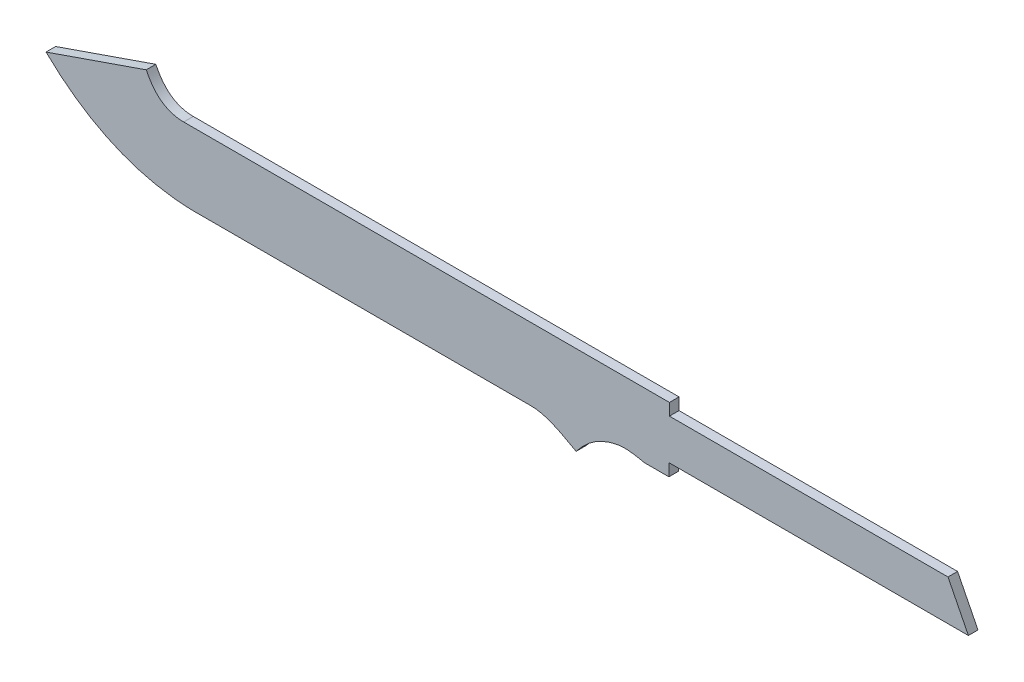
ISO-10303-21;
HEADER;
FILE_DESCRIPTION(('STEP AP214'),'2;1');
FILE_NAME('part.step','',(''),(''),'','','');
FILE_SCHEMA(('AUTOMOTIVE_DESIGN { 1 0 10303 214 1 1 1 1 }'));
ENDSEC;
DATA;
#1=APPLICATION_CONTEXT('core data for automotive mechanical design processes');
#2=APPLICATION_PROTOCOL_DEFINITION('international standard','automotive_design',2000,#1);
#3=PRODUCT_CONTEXT('',#1,'mechanical');
#4=PRODUCT('Part','Part','',(#3));
#5=PRODUCT_RELATED_PRODUCT_CATEGORY('part','',(#4));
#6=PRODUCT_DEFINITION_FORMATION('','',#4);
#7=PRODUCT_DEFINITION_CONTEXT('part definition',#1,'design');
#8=PRODUCT_DEFINITION('design','',#6,#7);
#9=PRODUCT_DEFINITION_SHAPE('','',#8);
#10=(LENGTH_UNIT() NAMED_UNIT(*) SI_UNIT(.MILLI.,.METRE.));
#11=(NAMED_UNIT(*) PLANE_ANGLE_UNIT() SI_UNIT($,.RADIAN.));
#12=(NAMED_UNIT(*) SI_UNIT($,.STERADIAN.) SOLID_ANGLE_UNIT());
#13=UNCERTAINTY_MEASURE_WITH_UNIT(LENGTH_MEASURE(1.E-05),#10,'distance_accuracy_value','');
#14=(GEOMETRIC_REPRESENTATION_CONTEXT(3) GLOBAL_UNCERTAINTY_ASSIGNED_CONTEXT((#13)) GLOBAL_UNIT_ASSIGNED_CONTEXT((#10,
#11,#12)) REPRESENTATION_CONTEXT('',''));
#15=CARTESIAN_POINT('',(0.,0.,0.));
#16=DIRECTION('',(0.,0.,1.));
#17=DIRECTION('',(1.,0.,0.));
#18=AXIS2_PLACEMENT_3D('',#15,#16,#17);
#19=CARTESIAN_POINT('',(831.647452370836,366.448530177289,3.5));
#20=DIRECTION('',(-0.893086000947505,-0.449885979901123,0.));
#21=DIRECTION('',(0.449885979901123,-0.893086000947505,0.));
#22=AXIS2_PLACEMENT_3D('',#19,#20,#21);
#23=PLANE('',#22);
#24=DIRECTION('',(-0.449885979901123,0.893086000947505,0.));
#25=VECTOR('',#24,1.);
#26=CARTESIAN_POINT('',(831.647452370836,366.448530177289,-3.5));
#27=LINE('',#26,#25);
#28=CARTESIAN_POINT('',(846.526721269649,336.911119918841,-3.5));
#29=VERTEX_POINT('',#28);
#30=CARTESIAN_POINT('',(831.647452370836,366.448530177289,-3.5));
#31=VERTEX_POINT('',#30);
#32=EDGE_CURVE('E167',#29,#31,#27,.T.);
#33=ORIENTED_EDGE('',*,*,#32,.T.);
#34=DIRECTION('',(0.,0.,-1.));
#35=VECTOR('',#34,1.);
#36=CARTESIAN_POINT('',(831.647452370836,366.448530177289,3.5));
#37=LINE('',#36,#35);
#38=CARTESIAN_POINT('',(831.647452370836,366.448530177289,3.5));
#39=VERTEX_POINT('',#38);
#40=EDGE_CURVE('E11',#39,#31,#37,.T.);
#41=ORIENTED_EDGE('',*,*,#40,.F.);
#42=DIRECTION('',(-0.449885979901123,0.893086000947505,0.));
#43=VECTOR('',#42,1.);
#44=CARTESIAN_POINT('',(831.647452370836,366.448530177289,3.5));
#45=LINE('',#44,#43);
#46=CARTESIAN_POINT('',(846.526721269649,336.911119918841,3.5));
#47=VERTEX_POINT('',#46);
#48=EDGE_CURVE('E218',#47,#39,#45,.T.);
#49=ORIENTED_EDGE('',*,*,#48,.F.);
#50=DIRECTION('',(0.,0.,-1.));
#51=VECTOR('',#50,1.);
#52=CARTESIAN_POINT('',(846.526721269649,336.911119918841,3.5));
#53=LINE('',#52,#51);
#54=EDGE_CURVE('E163',#47,#29,#53,.T.);
#55=ORIENTED_EDGE('',*,*,#54,.T.);
#56=EDGE_LOOP('',(#33,#41,#49,#55));
#57=FACE_BOUND('',#56,.T.);
#58=ADVANCED_FACE('F35',(#57),#23,.F.);
#59=CARTESIAN_POINT('',(831.647452370836,366.448530177289,3.5));
#60=DIRECTION('',(0.,-1.,0.));
#61=DIRECTION('',(0.,0.,-1.));
#62=AXIS2_PLACEMENT_3D('',#59,#60,#61);
#63=PLANE('',#62);
#64=DIRECTION('',(-1.,0.,0.));
#65=VECTOR('',#64,1.);
#66=CARTESIAN_POINT('',(831.647452370836,366.448530177289,-3.5));
#67=LINE('',#66,#65);
#68=CARTESIAN_POINT('',(628.572821228741,366.448530177289,-3.5));
#69=VERTEX_POINT('',#68);
#70=EDGE_CURVE('E170',#31,#69,#67,.T.);
#71=ORIENTED_EDGE('',*,*,#70,.T.);
#72=DIRECTION('',(0.,0.,-1.));
#73=VECTOR('',#72,1.);
#74=CARTESIAN_POINT('',(628.572821228741,366.448530177289,3.5));
#75=LINE('',#74,#73);
#76=CARTESIAN_POINT('',(628.572821228741,366.448530177289,3.5));
#77=VERTEX_POINT('',#76);
#78=EDGE_CURVE('E43',#77,#69,#75,.T.);
#79=ORIENTED_EDGE('',*,*,#78,.F.);
#80=DIRECTION('',(-1.,0.,0.));
#81=VECTOR('',#80,1.);
#82=CARTESIAN_POINT('',(831.647452370836,366.448530177289,3.5));
#83=LINE('',#82,#81);
#84=EDGE_CURVE('E112',#39,#77,#83,.T.);
#85=ORIENTED_EDGE('',*,*,#84,.F.);
#86=ORIENTED_EDGE('',*,*,#40,.T.);
#87=EDGE_LOOP('',(#71,#79,#85,#86));
#88=FACE_BOUND('',#87,.T.);
#89=ADVANCED_FACE('F291',(#88),#63,.F.);
#90=CARTESIAN_POINT('',(628.572821228741,366.448530177289,3.5));
#91=DIRECTION('',(-1.,0.,0.));
#92=DIRECTION('',(0.,0.,1.));
#93=AXIS2_PLACEMENT_3D('',#90,#91,#92);
#94=PLANE('',#93);
#95=DIRECTION('',(0.,1.,0.));
#96=VECTOR('',#95,1.);
#97=CARTESIAN_POINT('',(628.572821228741,366.448530177289,-3.5));
#98=LINE('',#97,#96);
#99=CARTESIAN_POINT('',(628.572821228741,375.10698999372,-3.5));
#100=VERTEX_POINT('',#99);
#101=EDGE_CURVE('E172',#69,#100,#98,.T.);
#102=ORIENTED_EDGE('',*,*,#101,.T.);
#103=DIRECTION('',(0.,0.,-1.));
#104=VECTOR('',#103,1.);
#105=CARTESIAN_POINT('',(628.572821228741,375.10698999372,3.5));
#106=LINE('',#105,#104);
#107=CARTESIAN_POINT('',(628.572821228741,375.10698999372,3.5));
#108=VERTEX_POINT('',#107);
#109=EDGE_CURVE('E243',#108,#100,#106,.T.);
#110=ORIENTED_EDGE('',*,*,#109,.F.);
#111=DIRECTION('',(0.,1.,0.));
#112=VECTOR('',#111,1.);
#113=CARTESIAN_POINT('',(628.572821228741,366.448530177289,3.5));
#114=LINE('',#113,#112);
#115=EDGE_CURVE('E251',#77,#108,#114,.T.);
#116=ORIENTED_EDGE('',*,*,#115,.F.);
#117=ORIENTED_EDGE('',*,*,#78,.T.);
#118=EDGE_LOOP('',(#102,#110,#116,#117));
#119=FACE_BOUND('',#118,.T.);
#120=ADVANCED_FACE('F249',(#119),#94,.F.);
#121=CARTESIAN_POINT('',(628.572821228741,375.10698999372,3.5));
#122=DIRECTION('',(0.,-1.,0.));
#123=DIRECTION('',(0.,0.,-1.));
#124=AXIS2_PLACEMENT_3D('',#121,#122,#123);
#125=PLANE('',#124);
#126=DIRECTION('',(-1.,0.,0.));
#127=VECTOR('',#126,1.);
#128=CARTESIAN_POINT('',(628.572821228741,375.10698999372,-3.5));
#129=LINE('',#128,#127);
#130=CARTESIAN_POINT('',(274.428895498994,375.10698999372,-3.5));
#131=VERTEX_POINT('',#130);
#132=EDGE_CURVE('E174',#100,#131,#129,.T.);
#133=ORIENTED_EDGE('',*,*,#132,.T.);
#134=DIRECTION('',(0.,0.,-1.));
#135=VECTOR('',#134,1.);
#136=CARTESIAN_POINT('',(274.428895498994,375.10698999372,3.5));
#137=LINE('',#136,#135);
#138=CARTESIAN_POINT('',(274.428895498994,375.10698999372,3.5));
#139=VERTEX_POINT('',#138);
#140=EDGE_CURVE('E240',#139,#131,#137,.T.);
#141=ORIENTED_EDGE('',*,*,#140,.F.);
#142=DIRECTION('',(-1.,0.,0.));
#143=VECTOR('',#142,1.);
#144=CARTESIAN_POINT('',(628.572821228741,375.10698999372,3.5));
#145=LINE('',#144,#143);
#146=EDGE_CURVE('E269',#108,#139,#145,.T.);
#147=ORIENTED_EDGE('',*,*,#146,.F.);
#148=ORIENTED_EDGE('',*,*,#109,.T.);
#149=EDGE_LOOP('',(#133,#141,#147,#148));
#150=FACE_BOUND('',#149,.T.);
#151=ADVANCED_FACE('F260',(#150),#125,.F.);
#152=CARTESIAN_POINT('',(274.428895498994,375.10698999372,3.5));
#153=CARTESIAN_POINT('',(256.358547923985,375.10698999372,3.5));
#154=CARTESIAN_POINT('',(247.122592496758,394.38356937402,3.5));
#155=B_SPLINE_CURVE_WITH_KNOTS('',2,(#152,#153,#154),.UNSPECIFIED.,.F.,.F.,(3,3),(0.,1.),.UNSPECIFIED.);
#156=DIRECTION('',(0.,0.,-1.));
#157=VECTOR('',#156,1.);
#158=SURFACE_OF_LINEAR_EXTRUSION('',#155,#157);
#159=CARTESIAN_POINT('',(274.428895498994,375.10698999372,-3.5));
#160=CARTESIAN_POINT('',(256.358547923985,375.10698999372,-3.5));
#161=CARTESIAN_POINT('',(247.122592496758,394.38356937402,-3.5));
#162=B_SPLINE_CURVE_WITH_KNOTS('',2,(#159,#160,#161),.UNSPECIFIED.,.F.,.F.,(3,3),(0.,1.),.UNSPECIFIED.);
#163=CARTESIAN_POINT('',(247.122592496758,394.38356937402,-3.5));
#164=VERTEX_POINT('',#163);
#165=EDGE_CURVE('E176',#131,#164,#162,.T.);
#166=ORIENTED_EDGE('',*,*,#165,.T.);
#167=DIRECTION('',(0.,0.,-1.));
#168=VECTOR('',#167,1.);
#169=CARTESIAN_POINT('',(247.122592496758,394.38356937402,3.5));
#170=LINE('',#169,#168);
#171=CARTESIAN_POINT('',(247.122592496758,394.38356937402,3.5));
#172=VERTEX_POINT('',#171);
#173=EDGE_CURVE('E237',#172,#164,#170,.T.);
#174=ORIENTED_EDGE('',*,*,#173,.F.);
#175=EDGE_CURVE('E266',#139,#172,#155,.T.);
#176=ORIENTED_EDGE('',*,*,#175,.F.);
#177=ORIENTED_EDGE('',*,*,#140,.T.);
#178=EDGE_LOOP('',(#166,#174,#176,#177));
#179=FACE_BOUND('',#178,.T.);
#180=ADVANCED_FACE('F264',(#179),#158,.F.);
#181=CARTESIAN_POINT('',(247.122592496758,394.38356937402,3.5));
#182=DIRECTION('',(0.327110563883166,-0.944986073440258,0.));
#183=DIRECTION('',(0.944986073440258,0.327110563883166,0.));
#184=AXIS2_PLACEMENT_3D('',#181,#182,#183);
#185=PLANE('',#184);
#186=DIRECTION('',(-0.944986073440258,-0.327110563883166,0.));
#187=VECTOR('',#186,1.);
#188=CARTESIAN_POINT('',(247.122592496758,394.38356937402,-3.5));
#189=LINE('',#188,#187);
#190=CARTESIAN_POINT('',(174.038075637833,369.085082769007,-3.5));
#191=VERTEX_POINT('',#190);
#192=EDGE_CURVE('E180',#164,#191,#189,.T.);
#193=ORIENTED_EDGE('',*,*,#192,.T.);
#194=DIRECTION('',(0.,0.,-1.));
#195=VECTOR('',#194,1.);
#196=CARTESIAN_POINT('',(174.038075637833,369.085082769007,3.5));
#197=LINE('',#196,#195);
#198=CARTESIAN_POINT('',(174.038075637833,369.085082769007,3.5));
#199=VERTEX_POINT('',#198);
#200=EDGE_CURVE('E234',#199,#191,#197,.T.);
#201=ORIENTED_EDGE('',*,*,#200,.F.);
#202=DIRECTION('',(-0.944986073440258,-0.327110563883166,0.));
#203=VECTOR('',#202,1.);
#204=CARTESIAN_POINT('',(247.122592496758,394.38356937402,3.5));
#205=LINE('',#204,#203);
#206=EDGE_CURVE('E268',#172,#199,#205,.T.);
#207=ORIENTED_EDGE('',*,*,#206,.F.);
#208=ORIENTED_EDGE('',*,*,#173,.T.);
#209=EDGE_LOOP('',(#193,#201,#207,#208));
#210=FACE_BOUND('',#209,.T.);
#211=ADVANCED_FACE('F286',(#210),#185,.F.);
#212=CARTESIAN_POINT('',(174.038075637833,369.085082769007,3.5));
#213=CARTESIAN_POINT('',(207.417770849194,336.709288165507,3.5));
#214=CARTESIAN_POINT('',(244.126187853179,323.555937747538,3.5));
#215=CARTESIAN_POINT('',(280.251563050941,322.503742353429,3.5));
#216=B_SPLINE_CURVE_WITH_KNOTS('',3,(#212,#213,#214,#215),.UNSPECIFIED.,.F.,.F.,(4,4),(0.,1.),.UNSPECIFIED.);
#217=DIRECTION('',(0.,0.,-1.));
#218=VECTOR('',#217,1.);
#219=SURFACE_OF_LINEAR_EXTRUSION('',#216,#218);
#220=CARTESIAN_POINT('',(174.038075637833,369.085082769007,-3.5));
#221=CARTESIAN_POINT('',(207.417770849194,336.709288165507,-3.5));
#222=CARTESIAN_POINT('',(244.126187853179,323.555937747538,-3.5));
#223=CARTESIAN_POINT('',(280.251563050941,322.503742353429,-3.5));
#224=B_SPLINE_CURVE_WITH_KNOTS('',3,(#220,#221,#222,#223),.UNSPECIFIED.,.F.,.F.,(4,4),(0.,1.),.UNSPECIFIED.);
#225=CARTESIAN_POINT('',(280.251563050941,322.503742353429,-3.5));
#226=VERTEX_POINT('',#225);
#227=EDGE_CURVE('E185',#191,#226,#224,.T.);
#228=ORIENTED_EDGE('',*,*,#227,.T.);
#229=DIRECTION('',(0.,0.,-1.));
#230=VECTOR('',#229,1.);
#231=CARTESIAN_POINT('',(280.251563050941,322.503742353429,3.5));
#232=LINE('',#231,#230);
#233=CARTESIAN_POINT('',(280.251563050941,322.503742353429,3.5));
#234=VERTEX_POINT('',#233);
#235=EDGE_CURVE('E231',#234,#226,#232,.T.);
#236=ORIENTED_EDGE('',*,*,#235,.F.);
#237=EDGE_CURVE('E271',#199,#234,#216,.T.);
#238=ORIENTED_EDGE('',*,*,#237,.F.);
#239=ORIENTED_EDGE('',*,*,#200,.T.);
#240=EDGE_LOOP('',(#228,#236,#238,#239));
#241=FACE_BOUND('',#240,.T.);
#242=ADVANCED_FACE('F324',(#241),#219,.F.);
#243=CARTESIAN_POINT('',(280.251563050941,322.503742353429,3.5));
#244=DIRECTION('',(0.,1.,0.));
#245=DIRECTION('',(0.,0.,1.));
#246=AXIS2_PLACEMENT_3D('',#243,#244,#245);
#247=PLANE('',#246);
#248=DIRECTION('',(1.,0.,0.));
#249=VECTOR('',#248,1.);
#250=CARTESIAN_POINT('',(280.251563050941,322.503742353429,-3.5));
#251=LINE('',#250,#249);
#252=CARTESIAN_POINT('',(527.843524378367,322.503742353429,-3.5));
#253=VERTEX_POINT('',#252);
#254=EDGE_CURVE('E189',#226,#253,#251,.T.);
#255=ORIENTED_EDGE('',*,*,#254,.T.);
#256=DIRECTION('',(0.,0.,-1.));
#257=VECTOR('',#256,1.);
#258=CARTESIAN_POINT('',(527.843524378367,322.503742353429,3.5));
#259=LINE('',#258,#257);
#260=CARTESIAN_POINT('',(527.843524378367,322.503742353429,3.5));
#261=VERTEX_POINT('',#260);
#262=EDGE_CURVE('E228',#261,#253,#259,.T.);
#263=ORIENTED_EDGE('',*,*,#262,.F.);
#264=DIRECTION('',(1.,0.,0.));
#265=VECTOR('',#264,1.);
#266=CARTESIAN_POINT('',(280.251563050941,322.503742353429,3.5));
#267=LINE('',#266,#265);
#268=EDGE_CURVE('E321',#234,#261,#267,.T.);
#269=ORIENTED_EDGE('',*,*,#268,.F.);
#270=ORIENTED_EDGE('',*,*,#235,.T.);
#271=EDGE_LOOP('',(#255,#263,#269,#270));
#272=FACE_BOUND('',#271,.T.);
#273=ADVANCED_FACE('F318',(#272),#247,.F.);
#274=CARTESIAN_POINT('',(527.843524378367,322.503742353429,3.5));
#275=CARTESIAN_POINT('',(541.993033663946,322.503742353429,3.5));
#276=CARTESIAN_POINT('',(557.358077916734,311.262922102544,3.5));
#277=CARTESIAN_POINT('',(560.616559044753,310.285377764138,3.5));
#278=B_SPLINE_CURVE_WITH_KNOTS('',3,(#274,#275,#276,#277),.UNSPECIFIED.,.F.,.F.,(4,4),(0.,1.),.UNSPECIFIED.);
#279=DIRECTION('',(0.,0.,-1.));
#280=VECTOR('',#279,1.);
#281=SURFACE_OF_LINEAR_EXTRUSION('',#278,#280);
#282=CARTESIAN_POINT('',(527.843524378367,322.503742353429,-3.5));
#283=CARTESIAN_POINT('',(541.993033663946,322.503742353429,-3.5));
#284=CARTESIAN_POINT('',(557.358077916734,311.262922102544,-3.5));
#285=CARTESIAN_POINT('',(560.616559044753,310.285377764138,-3.5));
#286=B_SPLINE_CURVE_WITH_KNOTS('',3,(#282,#283,#284,#285),.UNSPECIFIED.,.F.,.F.,(4,4),(0.,1.),.UNSPECIFIED.);
#287=CARTESIAN_POINT('',(560.616559044753,310.285377764138,-3.5));
#288=VERTEX_POINT('',#287);
#289=EDGE_CURVE('E194',#253,#288,#286,.T.);
#290=ORIENTED_EDGE('',*,*,#289,.T.);
#291=DIRECTION('',(0.,0.,-1.));
#292=VECTOR('',#291,1.);
#293=CARTESIAN_POINT('',(560.616559044753,310.285377764138,3.5));
#294=LINE('',#293,#292);
#295=CARTESIAN_POINT('',(560.616559044753,310.285377764138,3.5));
#296=VERTEX_POINT('',#295);
#297=EDGE_CURVE('E225',#296,#288,#294,.T.);
#298=ORIENTED_EDGE('',*,*,#297,.F.);
#299=EDGE_CURVE('E313',#261,#296,#278,.T.);
#300=ORIENTED_EDGE('',*,*,#299,.F.);
#301=ORIENTED_EDGE('',*,*,#262,.T.);
#302=EDGE_LOOP('',(#290,#298,#300,#301));
#303=FACE_BOUND('',#302,.T.);
#304=ADVANCED_FACE('F312',(#303),#281,.F.);
#305=CARTESIAN_POINT('',(560.616559044753,310.285377764138,3.5));
#306=CARTESIAN_POINT('',(569.016239064924,321.364266066606,3.5));
#307=CARTESIAN_POINT('',(579.472757250384,327.823555693635,3.5));
#308=CARTESIAN_POINT('',(591.986113601132,329.663246645226,3.5));
#309=B_SPLINE_CURVE_WITH_KNOTS('',3,(#305,#306,#307,#308),.UNSPECIFIED.,.F.,.F.,(4,4),(0.,1.),.UNSPECIFIED.);
#310=DIRECTION('',(0.,0.,-1.));
#311=VECTOR('',#310,1.);
#312=SURFACE_OF_LINEAR_EXTRUSION('',#309,#311);
#313=CARTESIAN_POINT('',(560.616559044753,310.285377764138,-3.5));
#314=CARTESIAN_POINT('',(569.016239064924,321.364266066606,-3.5));
#315=CARTESIAN_POINT('',(579.472757250384,327.823555693635,-3.5));
#316=CARTESIAN_POINT('',(591.986113601132,329.663246645226,-3.5));
#317=B_SPLINE_CURVE_WITH_KNOTS('',3,(#313,#314,#315,#316),.UNSPECIFIED.,.F.,.F.,(4,4),(0.,1.),.UNSPECIFIED.);
#318=CARTESIAN_POINT('',(591.986113601132,329.663246645226,-3.5));
#319=VERTEX_POINT('',#318);
#320=EDGE_CURVE('E198',#288,#319,#317,.T.);
#321=ORIENTED_EDGE('',*,*,#320,.T.);
#322=DIRECTION('',(0.,0.,-1.));
#323=VECTOR('',#322,1.);
#324=CARTESIAN_POINT('',(591.986113601132,329.663246645226,3.5));
#325=LINE('',#324,#323);
#326=CARTESIAN_POINT('',(591.986113601132,329.663246645226,3.5));
#327=VERTEX_POINT('',#326);
#328=EDGE_CURVE('E222',#327,#319,#325,.T.);
#329=ORIENTED_EDGE('',*,*,#328,.F.);
#330=EDGE_CURVE('E308',#296,#327,#309,.T.);
#331=ORIENTED_EDGE('',*,*,#330,.F.);
#332=ORIENTED_EDGE('',*,*,#297,.T.);
#333=EDGE_LOOP('',(#321,#329,#331,#332));
#334=FACE_BOUND('',#333,.T.);
#335=ADVANCED_FACE('F307',(#334),#312,.F.);
#336=CARTESIAN_POINT('',(591.986113601132,329.663246645226,3.5));
#337=CARTESIAN_POINT('',(599.533888677184,330.772906845322,3.5));
#338=CARTESIAN_POINT('',(610.017065826372,327.932538720226,3.5));
#339=CARTESIAN_POINT('',(610.038691556529,327.932538720226,3.5));
#340=B_SPLINE_CURVE_WITH_KNOTS('',3,(#336,#337,#338,#339),.UNSPECIFIED.,.F.,.F.,(4,4),(0.,1.),.UNSPECIFIED.);
#341=DIRECTION('',(0.,0.,-1.));
#342=VECTOR('',#341,1.);
#343=SURFACE_OF_LINEAR_EXTRUSION('',#340,#342);
#344=CARTESIAN_POINT('',(591.986113601132,329.663246645226,-3.5));
#345=CARTESIAN_POINT('',(599.533888677184,330.772906845322,-3.5));
#346=CARTESIAN_POINT('',(610.017065826372,327.932538720226,-3.5));
#347=CARTESIAN_POINT('',(610.038691556529,327.932538720226,-3.5));
#348=B_SPLINE_CURVE_WITH_KNOTS('',3,(#344,#345,#346,#347),.UNSPECIFIED.,.F.,.F.,(4,4),(0.,1.),.UNSPECIFIED.);
#349=CARTESIAN_POINT('',(610.038691556529,327.932538720226,-3.5));
#350=VERTEX_POINT('',#349);
#351=EDGE_CURVE('E205',#319,#350,#348,.T.);
#352=ORIENTED_EDGE('',*,*,#351,.T.);
#353=DIRECTION('',(0.,0.,-1.));
#354=VECTOR('',#353,1.);
#355=CARTESIAN_POINT('',(610.038691556529,327.932538720226,3.5));
#356=LINE('',#355,#354);
#357=CARTESIAN_POINT('',(610.038691556529,327.932538720226,3.5));
#358=VERTEX_POINT('',#357);
#359=EDGE_CURVE('E158',#358,#350,#356,.T.);
#360=ORIENTED_EDGE('',*,*,#359,.F.);
#361=EDGE_CURVE('E149',#327,#358,#340,.T.);
#362=ORIENTED_EDGE('',*,*,#361,.F.);
#363=ORIENTED_EDGE('',*,*,#328,.T.);
#364=EDGE_LOOP('',(#352,#360,#362,#363));
#365=FACE_BOUND('',#364,.T.);
#366=ADVANCED_FACE('F303',(#365),#343,.F.);
#367=CARTESIAN_POINT('',(610.038691556529,327.932538720226,3.5));
#368=DIRECTION('',(0.,1.,0.));
#369=DIRECTION('',(0.,0.,1.));
#370=AXIS2_PLACEMENT_3D('',#367,#368,#369);
#371=PLANE('',#370);
#372=DIRECTION('',(1.,0.,0.));
#373=VECTOR('',#372,1.);
#374=CARTESIAN_POINT('',(610.038691556529,327.932538720226,-3.5));
#375=LINE('',#374,#373);
#376=CARTESIAN_POINT('',(628.174793788627,327.932538720226,-3.5));
#377=VERTEX_POINT('',#376);
#378=EDGE_CURVE('E157',#350,#377,#375,.T.);
#379=ORIENTED_EDGE('',*,*,#378,.T.);
#380=DIRECTION('',(0.,0.,-1.));
#381=VECTOR('',#380,1.);
#382=CARTESIAN_POINT('',(628.174793788627,327.932538720226,3.5));
#383=LINE('',#382,#381);
#384=CARTESIAN_POINT('',(628.174793788627,327.932538720226,3.5));
#385=VERTEX_POINT('',#384);
#386=EDGE_CURVE('E154',#385,#377,#383,.T.);
#387=ORIENTED_EDGE('',*,*,#386,.F.);
#388=DIRECTION('',(1.,0.,0.));
#389=VECTOR('',#388,1.);
#390=CARTESIAN_POINT('',(610.038691556529,327.932538720226,3.5));
#391=LINE('',#390,#389);
#392=EDGE_CURVE('E143',#358,#385,#391,.T.);
#393=ORIENTED_EDGE('',*,*,#392,.F.);
#394=ORIENTED_EDGE('',*,*,#359,.T.);
#395=EDGE_LOOP('',(#379,#387,#393,#394));
#396=FACE_BOUND('',#395,.T.);
#397=ADVANCED_FACE('F155',(#396),#371,.F.);
#398=CARTESIAN_POINT('',(628.174793788627,327.932538720226,3.5));
#399=DIRECTION('',(-1.,0.,0.));
#400=DIRECTION('',(0.,0.,1.));
#401=AXIS2_PLACEMENT_3D('',#398,#399,#400);
#402=PLANE('',#401);
#403=DIRECTION('',(0.,1.,0.));
#404=VECTOR('',#403,1.);
#405=CARTESIAN_POINT('',(628.174793788627,327.932538720226,-3.5));
#406=LINE('',#405,#404);
#407=CARTESIAN_POINT('',(628.174793788627,336.911119918841,-3.5));
#408=VERTEX_POINT('',#407);
#409=EDGE_CURVE('E98',#377,#408,#406,.T.);
#410=ORIENTED_EDGE('',*,*,#409,.T.);
#411=DIRECTION('',(0.,0.,-1.));
#412=VECTOR('',#411,1.);
#413=CARTESIAN_POINT('',(628.174793788627,336.911119918841,3.5));
#414=LINE('',#413,#412);
#415=CARTESIAN_POINT('',(628.174793788627,336.911119918841,3.5));
#416=VERTEX_POINT('',#415);
#417=EDGE_CURVE('E159',#416,#408,#414,.T.);
#418=ORIENTED_EDGE('',*,*,#417,.F.);
#419=DIRECTION('',(0.,1.,0.));
#420=VECTOR('',#419,1.);
#421=CARTESIAN_POINT('',(628.174793788627,327.932538720226,3.5));
#422=LINE('',#421,#420);
#423=EDGE_CURVE('E147',#385,#416,#422,.T.);
#424=ORIENTED_EDGE('',*,*,#423,.F.);
#425=ORIENTED_EDGE('',*,*,#386,.T.);
#426=EDGE_LOOP('',(#410,#418,#424,#425));
#427=FACE_BOUND('',#426,.T.);
#428=ADVANCED_FACE('F161',(#427),#402,.F.);
#429=CARTESIAN_POINT('',(628.174793788627,336.911119918841,3.5));
#430=DIRECTION('',(0.,1.,0.));
#431=DIRECTION('',(0.,0.,1.));
#432=AXIS2_PLACEMENT_3D('',#429,#430,#431);
#433=PLANE('',#432);
#434=DIRECTION('',(1.,0.,0.));
#435=VECTOR('',#434,1.);
#436=CARTESIAN_POINT('',(628.174793788627,336.911119918841,-3.5));
#437=LINE('',#436,#435);
#438=EDGE_CURVE('E104',#408,#29,#437,.T.);
#439=ORIENTED_EDGE('',*,*,#438,.T.);
#440=ORIENTED_EDGE('',*,*,#54,.F.);
#441=DIRECTION('',(1.,0.,0.));
#442=VECTOR('',#441,1.);
#443=CARTESIAN_POINT('',(628.174793788627,336.911119918841,3.5));
#444=LINE('',#443,#442);
#445=EDGE_CURVE('E51',#416,#47,#444,.T.);
#446=ORIENTED_EDGE('',*,*,#445,.F.);
#447=ORIENTED_EDGE('',*,*,#417,.T.);
#448=EDGE_LOOP('',(#439,#440,#446,#447));
#449=FACE_BOUND('',#448,.T.);
#450=ADVANCED_FACE('F367',(#449),#433,.F.);
#451=CARTESIAN_POINT('',(603.834708583541,329.214015257762,3.5));
#452=DIRECTION('',(0.,0.,1.));
#453=DIRECTION('',(1.,0.,0.));
#454=AXIS2_PLACEMENT_3D('',#451,#452,#453);
#455=PLANE('',#454);
#456=ORIENTED_EDGE('',*,*,#48,.T.);
#457=ORIENTED_EDGE('',*,*,#84,.T.);
#458=ORIENTED_EDGE('',*,*,#115,.T.);
#459=ORIENTED_EDGE('',*,*,#146,.T.);
#460=ORIENTED_EDGE('',*,*,#175,.T.);
#461=ORIENTED_EDGE('',*,*,#206,.T.);
#462=ORIENTED_EDGE('',*,*,#237,.T.);
#463=ORIENTED_EDGE('',*,*,#268,.T.);
#464=ORIENTED_EDGE('',*,*,#299,.T.);
#465=ORIENTED_EDGE('',*,*,#330,.T.);
#466=ORIENTED_EDGE('',*,*,#361,.T.);
#467=ORIENTED_EDGE('',*,*,#392,.T.);
#468=ORIENTED_EDGE('',*,*,#423,.T.);
#469=ORIENTED_EDGE('',*,*,#445,.T.);
#470=EDGE_LOOP('',(#456,#457,#458,#459,#460,#461,#462,#463,#464,#465,#466,#467,#468,#469));
#471=FACE_BOUND('',#470,.T.);
#472=ADVANCED_FACE('F145',(#471),#455,.T.);
#473=CARTESIAN_POINT('',(603.834708583541,329.214015257762,-3.5));
#474=DIRECTION('',(0.,0.,1.));
#475=DIRECTION('',(1.,0.,0.));
#476=AXIS2_PLACEMENT_3D('',#473,#474,#475);
#477=PLANE('',#476);
#478=ORIENTED_EDGE('',*,*,#32,.F.);
#479=ORIENTED_EDGE('',*,*,#438,.F.);
#480=ORIENTED_EDGE('',*,*,#409,.F.);
#481=ORIENTED_EDGE('',*,*,#378,.F.);
#482=ORIENTED_EDGE('',*,*,#351,.F.);
#483=ORIENTED_EDGE('',*,*,#320,.F.);
#484=ORIENTED_EDGE('',*,*,#289,.F.);
#485=ORIENTED_EDGE('',*,*,#254,.F.);
#486=ORIENTED_EDGE('',*,*,#227,.F.);
#487=ORIENTED_EDGE('',*,*,#192,.F.);
#488=ORIENTED_EDGE('',*,*,#165,.F.);
#489=ORIENTED_EDGE('',*,*,#132,.F.);
#490=ORIENTED_EDGE('',*,*,#101,.F.);
#491=ORIENTED_EDGE('',*,*,#70,.F.);
#492=EDGE_LOOP('',(#478,#479,#480,#481,#482,#483,#484,#485,#486,#487,#488,#489,#490,#491));
#493=FACE_BOUND('',#492,.T.);
#494=ADVANCED_FACE('F255',(#493),#477,.F.);
#495=CLOSED_SHELL('',(#58,#89,#120,#151,#180,#211,#242,#273,#304,#335,#366,#397,#428,#450,#472,#494));
#496=MANIFOLD_SOLID_BREP('B2',#495);
#497=ADVANCED_BREP_SHAPE_REPRESENTATION('',(#18,#496),#14);
#498=SHAPE_DEFINITION_REPRESENTATION(#9,#497);
ENDSEC;
END-ISO-10303-21;
